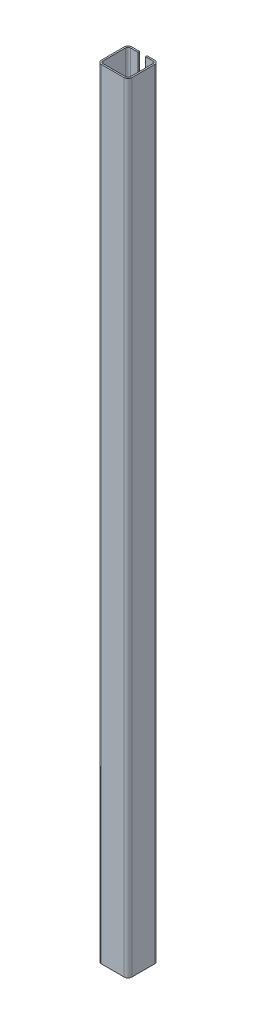
ISO-10303-21;
HEADER;
FILE_DESCRIPTION(('STEP AP214'),'2;1');
FILE_NAME('part.step','',(''),(''),'','','');
FILE_SCHEMA(('AUTOMOTIVE_DESIGN { 1 0 10303 214 1 1 1 1 }'));
ENDSEC;
DATA;
#1=APPLICATION_CONTEXT('core data for automotive mechanical design processes');
#2=APPLICATION_PROTOCOL_DEFINITION('international standard','automotive_design',2000,#1);
#3=PRODUCT_CONTEXT('',#1,'mechanical');
#4=PRODUCT('Part','Part','',(#3));
#5=PRODUCT_RELATED_PRODUCT_CATEGORY('part','',(#4));
#6=PRODUCT_DEFINITION_FORMATION('','',#4);
#7=PRODUCT_DEFINITION_CONTEXT('part definition',#1,'design');
#8=PRODUCT_DEFINITION('design','',#6,#7);
#9=PRODUCT_DEFINITION_SHAPE('','',#8);
#10=(LENGTH_UNIT() NAMED_UNIT(*) SI_UNIT(.MILLI.,.METRE.));
#11=(NAMED_UNIT(*) PLANE_ANGLE_UNIT() SI_UNIT($,.RADIAN.));
#12=(NAMED_UNIT(*) SI_UNIT($,.STERADIAN.) SOLID_ANGLE_UNIT());
#13=UNCERTAINTY_MEASURE_WITH_UNIT(LENGTH_MEASURE(1.E-05),#10,'distance_accuracy_value','');
#14=(GEOMETRIC_REPRESENTATION_CONTEXT(3) GLOBAL_UNCERTAINTY_ASSIGNED_CONTEXT((#13)) GLOBAL_UNIT_ASSIGNED_CONTEXT((#10,
#11,#12)) REPRESENTATION_CONTEXT('',''));
#15=CARTESIAN_POINT('',(0.,0.,0.));
#16=DIRECTION('',(0.,0.,1.));
#17=DIRECTION('',(1.,0.,0.));
#18=AXIS2_PLACEMENT_3D('',#15,#16,#17);
#19=CARTESIAN_POINT('',(-15.,1025.,-38.));
#20=DIRECTION('',(0.,0.,-1.));
#21=DIRECTION('',(-1.,0.,0.));
#22=AXIS2_PLACEMENT_3D('',#19,#20,#21);
#23=PLANE('',#22);
#24=DIRECTION('',(1.,0.,0.));
#25=VECTOR('',#24,1.);
#26=CARTESIAN_POINT('',(-15.,0.,-38.));
#27=LINE('',#26,#25);
#28=CARTESIAN_POINT('',(-15.,0.,-38.));
#29=VERTEX_POINT('',#28);
#30=CARTESIAN_POINT('',(-5.,0.,-38.));
#31=VERTEX_POINT('',#30);
#32=EDGE_CURVE('E222',#29,#31,#27,.T.);
#33=ORIENTED_EDGE('',*,*,#32,.T.);
#34=DIRECTION('',(0.,-1.,0.));
#35=VECTOR('',#34,1.);
#36=CARTESIAN_POINT('',(-5.,1025.,-38.));
#37=LINE('',#36,#35);
#38=CARTESIAN_POINT('',(-5.,1025.,-38.));
#39=VERTEX_POINT('',#38);
#40=EDGE_CURVE('E11',#39,#31,#37,.T.);
#41=ORIENTED_EDGE('',*,*,#40,.F.);
#42=DIRECTION('',(1.,0.,0.));
#43=VECTOR('',#42,1.);
#44=CARTESIAN_POINT('',(-15.,1025.,-38.));
#45=LINE('',#44,#43);
#46=CARTESIAN_POINT('',(-15.,1025.,-38.));
#47=VERTEX_POINT('',#46);
#48=EDGE_CURVE('E133',#47,#39,#45,.T.);
#49=ORIENTED_EDGE('',*,*,#48,.F.);
#50=DIRECTION('',(0.,-1.,0.));
#51=VECTOR('',#50,1.);
#52=CARTESIAN_POINT('',(-15.,1025.,-38.));
#53=LINE('',#52,#51);
#54=EDGE_CURVE('E218',#47,#29,#53,.T.);
#55=ORIENTED_EDGE('',*,*,#54,.T.);
#56=EDGE_LOOP('',(#33,#41,#49,#55));
#57=FACE_BOUND('',#56,.T.);
#58=ADVANCED_FACE('F40',(#57),#23,.F.);
#59=CARTESIAN_POINT('',(-5.,1025.,-40.));
#60=DIRECTION('',(1.,0.,0.));
#61=DIRECTION('',(0.,0.,-1.));
#62=AXIS2_PLACEMENT_3D('',#59,#60,#61);
#63=PLANE('',#62);
#64=DIRECTION('',(0.,0.,1.));
#65=VECTOR('',#64,1.);
#66=CARTESIAN_POINT('',(-5.,0.,-40.));
#67=LINE('',#66,#65);
#68=CARTESIAN_POINT('',(-5.,0.,-40.));
#69=VERTEX_POINT('',#68);
#70=EDGE_CURVE('E225',#69,#31,#67,.T.);
#71=ORIENTED_EDGE('',*,*,#70,.F.);
#72=DIRECTION('',(0.,-1.,0.));
#73=VECTOR('',#72,1.);
#74=CARTESIAN_POINT('',(-5.,1025.,-40.));
#75=LINE('',#74,#73);
#76=CARTESIAN_POINT('',(-5.,1025.,-40.));
#77=VERTEX_POINT('',#76);
#78=EDGE_CURVE('E49',#77,#69,#75,.T.);
#79=ORIENTED_EDGE('',*,*,#78,.F.);
#80=DIRECTION('',(0.,0.,1.));
#81=VECTOR('',#80,1.);
#82=CARTESIAN_POINT('',(-5.,1025.,-40.));
#83=LINE('',#82,#81);
#84=EDGE_CURVE('E345',#77,#39,#83,.T.);
#85=ORIENTED_EDGE('',*,*,#84,.T.);
#86=ORIENTED_EDGE('',*,*,#40,.T.);
#87=EDGE_LOOP('',(#71,#79,#85,#86));
#88=FACE_BOUND('',#87,.T.);
#89=ADVANCED_FACE('F332',(#88),#63,.T.);
#90=CARTESIAN_POINT('',(-15.,1025.,-40.));
#91=DIRECTION('',(0.,0.,-1.));
#92=DIRECTION('',(-1.,0.,0.));
#93=AXIS2_PLACEMENT_3D('',#90,#91,#92);
#94=PLANE('',#93);
#95=DIRECTION('',(1.,0.,0.));
#96=VECTOR('',#95,1.);
#97=CARTESIAN_POINT('',(-15.,0.,-40.));
#98=LINE('',#97,#96);
#99=CARTESIAN_POINT('',(-15.,0.,-40.));
#100=VERTEX_POINT('',#99);
#101=EDGE_CURVE('E228',#100,#69,#98,.T.);
#102=ORIENTED_EDGE('',*,*,#101,.F.);
#103=DIRECTION('',(0.,-1.,0.));
#104=VECTOR('',#103,1.);
#105=CARTESIAN_POINT('',(-15.,1025.,-40.));
#106=LINE('',#105,#104);
#107=CARTESIAN_POINT('',(-15.,1025.,-40.));
#108=VERTEX_POINT('',#107);
#109=EDGE_CURVE('E320',#108,#100,#106,.T.);
#110=ORIENTED_EDGE('',*,*,#109,.F.);
#111=DIRECTION('',(1.,0.,0.));
#112=VECTOR('',#111,1.);
#113=CARTESIAN_POINT('',(-15.,1025.,-40.));
#114=LINE('',#113,#112);
#115=EDGE_CURVE('E329',#108,#77,#114,.T.);
#116=ORIENTED_EDGE('',*,*,#115,.T.);
#117=ORIENTED_EDGE('',*,*,#78,.T.);
#118=EDGE_LOOP('',(#102,#110,#116,#117));
#119=FACE_BOUND('',#118,.T.);
#120=ADVANCED_FACE('F327',(#119),#94,.T.);
#121=CARTESIAN_POINT('',(-15.,1025.,-35.));
#122=DIRECTION('',(0.,-1.,0.));
#123=DIRECTION('',(0.,0.,-1.));
#124=AXIS2_PLACEMENT_3D('',#121,#122,#123);
#125=CYLINDRICAL_SURFACE('',#124,5.);
#126=CARTESIAN_POINT('',(-15.,0.,-35.));
#127=DIRECTION('',(0.,-1.,0.));
#128=DIRECTION('',(0.,0.,-1.));
#129=AXIS2_PLACEMENT_3D('',#126,#127,#128);
#130=CIRCLE('',#129,5.);
#131=CARTESIAN_POINT('',(-20.,0.,-35.));
#132=VERTEX_POINT('',#131);
#133=EDGE_CURVE('E231',#132,#100,#130,.T.);
#134=ORIENTED_EDGE('',*,*,#133,.F.);
#135=DIRECTION('',(0.,-1.,0.));
#136=VECTOR('',#135,1.);
#137=CARTESIAN_POINT('',(-20.,1025.,-35.));
#138=LINE('',#137,#136);
#139=CARTESIAN_POINT('',(-20.,1025.,-35.));
#140=VERTEX_POINT('',#139);
#141=EDGE_CURVE('E317',#140,#132,#138,.T.);
#142=ORIENTED_EDGE('',*,*,#141,.F.);
#143=CARTESIAN_POINT('',(-15.,1025.,-35.));
#144=DIRECTION('',(0.,-1.,0.));
#145=DIRECTION('',(0.,0.,-1.));
#146=AXIS2_PLACEMENT_3D('',#143,#144,#145);
#147=CIRCLE('',#146,5.);
#148=EDGE_CURVE('E342',#140,#108,#147,.T.);
#149=ORIENTED_EDGE('',*,*,#148,.T.);
#150=ORIENTED_EDGE('',*,*,#109,.T.);
#151=EDGE_LOOP('',(#134,#142,#149,#150));
#152=FACE_BOUND('',#151,.T.);
#153=ADVANCED_FACE('F339',(#152),#125,.T.);
#154=CARTESIAN_POINT('',(-20.,1025.,-5.00000000000004));
#155=DIRECTION('',(-1.,0.,0.));
#156=DIRECTION('',(0.,0.,1.));
#157=AXIS2_PLACEMENT_3D('',#154,#155,#156);
#158=PLANE('',#157);
#159=DIRECTION('',(0.,0.,-1.));
#160=VECTOR('',#159,1.);
#161=CARTESIAN_POINT('',(-20.,0.,-5.00000000000004));
#162=LINE('',#161,#160);
#163=CARTESIAN_POINT('',(-20.,0.,-5.00000000000003));
#164=VERTEX_POINT('',#163);
#165=EDGE_CURVE('E234',#164,#132,#162,.T.);
#166=ORIENTED_EDGE('',*,*,#165,.F.);
#167=DIRECTION('',(0.,-1.,0.));
#168=VECTOR('',#167,1.);
#169=CARTESIAN_POINT('',(-20.,1025.,-5.00000000000003));
#170=LINE('',#169,#168);
#171=CARTESIAN_POINT('',(-20.,1025.,-5.00000000000003));
#172=VERTEX_POINT('',#171);
#173=EDGE_CURVE('E314',#172,#164,#170,.T.);
#174=ORIENTED_EDGE('',*,*,#173,.F.);
#175=DIRECTION('',(0.,0.,-1.));
#176=VECTOR('',#175,1.);
#177=CARTESIAN_POINT('',(-20.,1025.,-5.00000000000004));
#178=LINE('',#177,#176);
#179=EDGE_CURVE('E347',#172,#140,#178,.T.);
#180=ORIENTED_EDGE('',*,*,#179,.T.);
#181=ORIENTED_EDGE('',*,*,#141,.T.);
#182=EDGE_LOOP('',(#166,#174,#180,#181));
#183=FACE_BOUND('',#182,.T.);
#184=ADVANCED_FACE('F420',(#183),#158,.T.);
#185=CARTESIAN_POINT('',(-15.,1025.,-5.));
#186=DIRECTION('',(0.,-1.,0.));
#187=DIRECTION('',(0.,0.,-1.));
#188=AXIS2_PLACEMENT_3D('',#185,#186,#187);
#189=CYLINDRICAL_SURFACE('',#188,5.);
#190=CARTESIAN_POINT('',(-15.,0.,-5.));
#191=DIRECTION('',(0.,-1.,0.));
#192=DIRECTION('',(0.,0.,-1.));
#193=AXIS2_PLACEMENT_3D('',#190,#191,#192);
#194=CIRCLE('',#193,5.);
#195=CARTESIAN_POINT('',(-15.,0.,0.));
#196=VERTEX_POINT('',#195);
#197=EDGE_CURVE('E237',#196,#164,#194,.T.);
#198=ORIENTED_EDGE('',*,*,#197,.F.);
#199=DIRECTION('',(0.,-1.,0.));
#200=VECTOR('',#199,1.);
#201=CARTESIAN_POINT('',(-15.,1025.,0.));
#202=LINE('',#201,#200);
#203=CARTESIAN_POINT('',(-15.,1025.,0.));
#204=VERTEX_POINT('',#203);
#205=EDGE_CURVE('E311',#204,#196,#202,.T.);
#206=ORIENTED_EDGE('',*,*,#205,.F.);
#207=CARTESIAN_POINT('',(-15.,1025.,-5.));
#208=DIRECTION('',(0.,-1.,0.));
#209=DIRECTION('',(0.,0.,-1.));
#210=AXIS2_PLACEMENT_3D('',#207,#208,#209);
#211=CIRCLE('',#210,5.);
#212=EDGE_CURVE('E353',#204,#172,#211,.T.);
#213=ORIENTED_EDGE('',*,*,#212,.T.);
#214=ORIENTED_EDGE('',*,*,#173,.T.);
#215=EDGE_LOOP('',(#198,#206,#213,#214));
#216=FACE_BOUND('',#215,.T.);
#217=ADVANCED_FACE('F423',(#216),#189,.T.);
#218=CARTESIAN_POINT('',(-15.,1025.,0.));
#219=DIRECTION('',(0.,0.,1.));
#220=DIRECTION('',(1.,0.,0.));
#221=AXIS2_PLACEMENT_3D('',#218,#219,#220);
#222=PLANE('',#221);
#223=DIRECTION('',(-1.,0.,0.));
#224=VECTOR('',#223,1.);
#225=CARTESIAN_POINT('',(-15.,0.,0.));
#226=LINE('',#225,#224);
#227=CARTESIAN_POINT('',(15.,0.,0.));
#228=VERTEX_POINT('',#227);
#229=EDGE_CURVE('E240',#228,#196,#226,.T.);
#230=ORIENTED_EDGE('',*,*,#229,.F.);
#231=DIRECTION('',(0.,-1.,0.));
#232=VECTOR('',#231,1.);
#233=CARTESIAN_POINT('',(15.,1025.,0.));
#234=LINE('',#233,#232);
#235=CARTESIAN_POINT('',(15.,1025.,0.));
#236=VERTEX_POINT('',#235);
#237=EDGE_CURVE('E308',#236,#228,#234,.T.);
#238=ORIENTED_EDGE('',*,*,#237,.F.);
#239=DIRECTION('',(-1.,0.,0.));
#240=VECTOR('',#239,1.);
#241=CARTESIAN_POINT('',(-15.,1025.,0.));
#242=LINE('',#241,#240);
#243=EDGE_CURVE('E356',#236,#204,#242,.T.);
#244=ORIENTED_EDGE('',*,*,#243,.T.);
#245=ORIENTED_EDGE('',*,*,#205,.T.);
#246=EDGE_LOOP('',(#230,#238,#244,#245));
#247=FACE_BOUND('',#246,.T.);
#248=ADVANCED_FACE('F427',(#247),#222,.T.);
#249=CARTESIAN_POINT('',(15.,1025.,-5.));
#250=DIRECTION('',(0.,-1.,0.));
#251=DIRECTION('',(0.,0.,-1.));
#252=AXIS2_PLACEMENT_3D('',#249,#250,#251);
#253=CYLINDRICAL_SURFACE('',#252,5.);
#254=CARTESIAN_POINT('',(15.,0.,-5.));
#255=DIRECTION('',(0.,-1.,0.));
#256=DIRECTION('',(0.,0.,1.));
#257=AXIS2_PLACEMENT_3D('',#254,#255,#256);
#258=CIRCLE('',#257,5.);
#259=CARTESIAN_POINT('',(20.,0.,-5.00000000000004));
#260=VERTEX_POINT('',#259);
#261=EDGE_CURVE('E243',#260,#228,#258,.T.);
#262=ORIENTED_EDGE('',*,*,#261,.F.);
#263=DIRECTION('',(0.,-1.,0.));
#264=VECTOR('',#263,1.);
#265=CARTESIAN_POINT('',(20.,1025.,-5.00000000000004));
#266=LINE('',#265,#264);
#267=CARTESIAN_POINT('',(20.,1025.,-5.00000000000004));
#268=VERTEX_POINT('',#267);
#269=EDGE_CURVE('E305',#268,#260,#266,.T.);
#270=ORIENTED_EDGE('',*,*,#269,.F.);
#271=CARTESIAN_POINT('',(15.,1025.,-5.));
#272=DIRECTION('',(0.,-1.,0.));
#273=DIRECTION('',(0.,0.,1.));
#274=AXIS2_PLACEMENT_3D('',#271,#272,#273);
#275=CIRCLE('',#274,5.);
#276=EDGE_CURVE('E360',#268,#236,#275,.T.);
#277=ORIENTED_EDGE('',*,*,#276,.T.);
#278=ORIENTED_EDGE('',*,*,#237,.T.);
#279=EDGE_LOOP('',(#262,#270,#277,#278));
#280=FACE_BOUND('',#279,.T.);
#281=ADVANCED_FACE('F431',(#280),#253,.T.);
#282=CARTESIAN_POINT('',(20.,1025.,-5.00000000000004));
#283=DIRECTION('',(1.,0.,0.));
#284=DIRECTION('',(0.,0.,-1.));
#285=AXIS2_PLACEMENT_3D('',#282,#283,#284);
#286=PLANE('',#285);
#287=DIRECTION('',(0.,0.,1.));
#288=VECTOR('',#287,1.);
#289=CARTESIAN_POINT('',(20.,0.,-5.00000000000004));
#290=LINE('',#289,#288);
#291=CARTESIAN_POINT('',(20.,0.,-35.));
#292=VERTEX_POINT('',#291);
#293=EDGE_CURVE('E246',#292,#260,#290,.T.);
#294=ORIENTED_EDGE('',*,*,#293,.F.);
#295=DIRECTION('',(0.,-1.,0.));
#296=VECTOR('',#295,1.);
#297=CARTESIAN_POINT('',(20.,1025.,-35.));
#298=LINE('',#297,#296);
#299=CARTESIAN_POINT('',(20.,1025.,-35.));
#300=VERTEX_POINT('',#299);
#301=EDGE_CURVE('E302',#300,#292,#298,.T.);
#302=ORIENTED_EDGE('',*,*,#301,.F.);
#303=DIRECTION('',(0.,0.,1.));
#304=VECTOR('',#303,1.);
#305=CARTESIAN_POINT('',(20.,1025.,-5.00000000000004));
#306=LINE('',#305,#304);
#307=EDGE_CURVE('E364',#300,#268,#306,.T.);
#308=ORIENTED_EDGE('',*,*,#307,.T.);
#309=ORIENTED_EDGE('',*,*,#269,.T.);
#310=EDGE_LOOP('',(#294,#302,#308,#309));
#311=FACE_BOUND('',#310,.T.);
#312=ADVANCED_FACE('F435',(#311),#286,.T.);
#313=CARTESIAN_POINT('',(15.,1025.,-35.));
#314=DIRECTION('',(0.,-1.,0.));
#315=DIRECTION('',(0.,0.,-1.));
#316=AXIS2_PLACEMENT_3D('',#313,#314,#315);
#317=CYLINDRICAL_SURFACE('',#316,5.);
#318=CARTESIAN_POINT('',(15.,0.,-35.));
#319=DIRECTION('',(0.,-1.,0.));
#320=DIRECTION('',(0.,0.,1.));
#321=AXIS2_PLACEMENT_3D('',#318,#319,#320);
#322=CIRCLE('',#321,5.);
#323=CARTESIAN_POINT('',(15.,0.,-40.));
#324=VERTEX_POINT('',#323);
#325=EDGE_CURVE('E249',#324,#292,#322,.T.);
#326=ORIENTED_EDGE('',*,*,#325,.F.);
#327=DIRECTION('',(0.,-1.,0.));
#328=VECTOR('',#327,1.);
#329=CARTESIAN_POINT('',(15.,1025.,-40.));
#330=LINE('',#329,#328);
#331=CARTESIAN_POINT('',(15.,1025.,-40.));
#332=VERTEX_POINT('',#331);
#333=EDGE_CURVE('E299',#332,#324,#330,.T.);
#334=ORIENTED_EDGE('',*,*,#333,.F.);
#335=CARTESIAN_POINT('',(15.,1025.,-35.));
#336=DIRECTION('',(0.,-1.,0.));
#337=DIRECTION('',(0.,0.,1.));
#338=AXIS2_PLACEMENT_3D('',#335,#336,#337);
#339=CIRCLE('',#338,5.);
#340=EDGE_CURVE('E368',#332,#300,#339,.T.);
#341=ORIENTED_EDGE('',*,*,#340,.T.);
#342=ORIENTED_EDGE('',*,*,#301,.T.);
#343=EDGE_LOOP('',(#326,#334,#341,#342));
#344=FACE_BOUND('',#343,.T.);
#345=ADVANCED_FACE('F439',(#344),#317,.T.);
#346=CARTESIAN_POINT('',(5.,1025.,-40.));
#347=DIRECTION('',(0.,0.,-1.));
#348=DIRECTION('',(-1.,0.,0.));
#349=AXIS2_PLACEMENT_3D('',#346,#347,#348);
#350=PLANE('',#349);
#351=DIRECTION('',(1.,0.,0.));
#352=VECTOR('',#351,1.);
#353=CARTESIAN_POINT('',(5.,0.,-40.));
#354=LINE('',#353,#352);
#355=CARTESIAN_POINT('',(5.,0.,-40.));
#356=VERTEX_POINT('',#355);
#357=EDGE_CURVE('E252',#356,#324,#354,.T.);
#358=ORIENTED_EDGE('',*,*,#357,.F.);
#359=DIRECTION('',(0.,-1.,0.));
#360=VECTOR('',#359,1.);
#361=CARTESIAN_POINT('',(5.,1025.,-40.));
#362=LINE('',#361,#360);
#363=CARTESIAN_POINT('',(5.,1025.,-40.));
#364=VERTEX_POINT('',#363);
#365=EDGE_CURVE('E296',#364,#356,#362,.T.);
#366=ORIENTED_EDGE('',*,*,#365,.F.);
#367=DIRECTION('',(1.,0.,0.));
#368=VECTOR('',#367,1.);
#369=CARTESIAN_POINT('',(5.,1025.,-40.));
#370=LINE('',#369,#368);
#371=EDGE_CURVE('E372',#364,#332,#370,.T.);
#372=ORIENTED_EDGE('',*,*,#371,.T.);
#373=ORIENTED_EDGE('',*,*,#333,.T.);
#374=EDGE_LOOP('',(#358,#366,#372,#373));
#375=FACE_BOUND('',#374,.T.);
#376=ADVANCED_FACE('F443',(#375),#350,.T.);
#377=CARTESIAN_POINT('',(5.,1025.,-38.));
#378=DIRECTION('',(-1.,0.,0.));
#379=DIRECTION('',(0.,0.,1.));
#380=AXIS2_PLACEMENT_3D('',#377,#378,#379);
#381=PLANE('',#380);
#382=DIRECTION('',(0.,0.,-1.));
#383=VECTOR('',#382,1.);
#384=CARTESIAN_POINT('',(5.,0.,-38.));
#385=LINE('',#384,#383);
#386=CARTESIAN_POINT('',(5.,0.,-38.));
#387=VERTEX_POINT('',#386);
#388=EDGE_CURVE('E255',#387,#356,#385,.T.);
#389=ORIENTED_EDGE('',*,*,#388,.F.);
#390=DIRECTION('',(0.,-1.,0.));
#391=VECTOR('',#390,1.);
#392=CARTESIAN_POINT('',(5.,1025.,-38.));
#393=LINE('',#392,#391);
#394=CARTESIAN_POINT('',(5.,1025.,-38.));
#395=VERTEX_POINT('',#394);
#396=EDGE_CURVE('E293',#395,#387,#393,.T.);
#397=ORIENTED_EDGE('',*,*,#396,.F.);
#398=DIRECTION('',(0.,0.,-1.));
#399=VECTOR('',#398,1.);
#400=CARTESIAN_POINT('',(5.,1025.,-38.));
#401=LINE('',#400,#399);
#402=EDGE_CURVE('E375',#395,#364,#401,.T.);
#403=ORIENTED_EDGE('',*,*,#402,.T.);
#404=ORIENTED_EDGE('',*,*,#365,.T.);
#405=EDGE_LOOP('',(#389,#397,#403,#404));
#406=FACE_BOUND('',#405,.T.);
#407=ADVANCED_FACE('F447',(#406),#381,.T.);
#408=CARTESIAN_POINT('',(5.,1025.,-38.));
#409=DIRECTION('',(0.,0.,-1.));
#410=DIRECTION('',(-1.,0.,0.));
#411=AXIS2_PLACEMENT_3D('',#408,#409,#410);
#412=PLANE('',#411);
#413=DIRECTION('',(1.,0.,0.));
#414=VECTOR('',#413,1.);
#415=CARTESIAN_POINT('',(5.,0.,-38.));
#416=LINE('',#415,#414);
#417=CARTESIAN_POINT('',(15.,0.,-38.));
#418=VERTEX_POINT('',#417);
#419=EDGE_CURVE('E258',#387,#418,#416,.T.);
#420=ORIENTED_EDGE('',*,*,#419,.T.);
#421=DIRECTION('',(0.,-1.,0.));
#422=VECTOR('',#421,1.);
#423=CARTESIAN_POINT('',(15.,1025.,-38.));
#424=LINE('',#423,#422);
#425=CARTESIAN_POINT('',(15.,1025.,-38.));
#426=VERTEX_POINT('',#425);
#427=EDGE_CURVE('E289',#426,#418,#424,.T.);
#428=ORIENTED_EDGE('',*,*,#427,.F.);
#429=DIRECTION('',(1.,0.,0.));
#430=VECTOR('',#429,1.);
#431=CARTESIAN_POINT('',(5.,1025.,-38.));
#432=LINE('',#431,#430);
#433=EDGE_CURVE('E378',#395,#426,#432,.T.);
#434=ORIENTED_EDGE('',*,*,#433,.F.);
#435=ORIENTED_EDGE('',*,*,#396,.T.);
#436=EDGE_LOOP('',(#420,#428,#434,#435));
#437=FACE_BOUND('',#436,.T.);
#438=ADVANCED_FACE('F451',(#437),#412,.F.);
#439=CARTESIAN_POINT('',(15.,1025.,-35.));
#440=DIRECTION('',(0.,-1.,0.));
#441=DIRECTION('',(0.,0.,-1.));
#442=AXIS2_PLACEMENT_3D('',#439,#440,#441);
#443=CYLINDRICAL_SURFACE('',#442,3.);
#444=CARTESIAN_POINT('',(15.,0.,-35.));
#445=DIRECTION('',(0.,1.,0.));
#446=DIRECTION('',(1.,0.,0.));
#447=AXIS2_PLACEMENT_3D('',#444,#445,#446);
#448=CIRCLE('',#447,3.);
#449=CARTESIAN_POINT('',(18.,0.,-35.));
#450=VERTEX_POINT('',#449);
#451=EDGE_CURVE('E260',#418,#450,#448,.F.);
#452=ORIENTED_EDGE('',*,*,#451,.T.);
#453=DIRECTION('',(0.,-1.,0.));
#454=VECTOR('',#453,1.);
#455=CARTESIAN_POINT('',(18.,1025.,-35.));
#456=LINE('',#455,#454);
#457=CARTESIAN_POINT('',(18.,1025.,-35.));
#458=VERTEX_POINT('',#457);
#459=EDGE_CURVE('E285',#458,#450,#456,.T.);
#460=ORIENTED_EDGE('',*,*,#459,.F.);
#461=CARTESIAN_POINT('',(15.,1025.,-35.));
#462=DIRECTION('',(0.,1.,0.));
#463=DIRECTION('',(1.,0.,0.));
#464=AXIS2_PLACEMENT_3D('',#461,#462,#463);
#465=CIRCLE('',#464,3.);
#466=EDGE_CURVE('E380',#426,#458,#465,.F.);
#467=ORIENTED_EDGE('',*,*,#466,.F.);
#468=ORIENTED_EDGE('',*,*,#427,.T.);
#469=EDGE_LOOP('',(#452,#460,#467,#468));
#470=FACE_BOUND('',#469,.T.);
#471=ADVANCED_FACE('F455',(#470),#443,.F.);
#472=CARTESIAN_POINT('',(18.,1025.,-5.00000000000004));
#473=DIRECTION('',(1.,0.,0.));
#474=DIRECTION('',(0.,0.,-1.));
#475=AXIS2_PLACEMENT_3D('',#472,#473,#474);
#476=PLANE('',#475);
#477=DIRECTION('',(0.,0.,-1.));
#478=VECTOR('',#477,1.);
#479=CARTESIAN_POINT('',(18.,0.,-5.00000000000004));
#480=LINE('',#479,#478);
#481=CARTESIAN_POINT('',(18.,0.,-5.00000000000002));
#482=VERTEX_POINT('',#481);
#483=EDGE_CURVE('E262',#450,#482,#480,.F.);
#484=ORIENTED_EDGE('',*,*,#483,.T.);
#485=DIRECTION('',(0.,-1.,0.));
#486=VECTOR('',#485,1.);
#487=CARTESIAN_POINT('',(18.,1025.,-5.00000000000002));
#488=LINE('',#487,#486);
#489=CARTESIAN_POINT('',(18.,1025.,-5.00000000000002));
#490=VERTEX_POINT('',#489);
#491=EDGE_CURVE('E281',#490,#482,#488,.T.);
#492=ORIENTED_EDGE('',*,*,#491,.F.);
#493=DIRECTION('',(0.,0.,-1.));
#494=VECTOR('',#493,1.);
#495=CARTESIAN_POINT('',(18.,1025.,-5.00000000000004));
#496=LINE('',#495,#494);
#497=EDGE_CURVE('E382',#458,#490,#496,.F.);
#498=ORIENTED_EDGE('',*,*,#497,.F.);
#499=ORIENTED_EDGE('',*,*,#459,.T.);
#500=EDGE_LOOP('',(#484,#492,#498,#499));
#501=FACE_BOUND('',#500,.T.);
#502=ADVANCED_FACE('F459',(#501),#476,.F.);
#503=CARTESIAN_POINT('',(15.,1025.,-5.));
#504=DIRECTION('',(0.,-1.,0.));
#505=DIRECTION('',(0.,0.,-1.));
#506=AXIS2_PLACEMENT_3D('',#503,#504,#505);
#507=CYLINDRICAL_SURFACE('',#506,3.);
#508=CARTESIAN_POINT('',(15.,0.,-5.));
#509=DIRECTION('',(0.,1.,0.));
#510=DIRECTION('',(1.,0.,0.));
#511=AXIS2_PLACEMENT_3D('',#508,#509,#510);
#512=CIRCLE('',#511,3.);
#513=CARTESIAN_POINT('',(15.,0.,-2.));
#514=VERTEX_POINT('',#513);
#515=EDGE_CURVE('E264',#482,#514,#512,.F.);
#516=ORIENTED_EDGE('',*,*,#515,.T.);
#517=DIRECTION('',(0.,-1.,0.));
#518=VECTOR('',#517,1.);
#519=CARTESIAN_POINT('',(15.,1025.,-2.));
#520=LINE('',#519,#518);
#521=CARTESIAN_POINT('',(15.,1025.,-2.));
#522=VERTEX_POINT('',#521);
#523=EDGE_CURVE('E277',#522,#514,#520,.T.);
#524=ORIENTED_EDGE('',*,*,#523,.F.);
#525=CARTESIAN_POINT('',(15.,1025.,-5.));
#526=DIRECTION('',(0.,1.,0.));
#527=DIRECTION('',(1.,0.,0.));
#528=AXIS2_PLACEMENT_3D('',#525,#526,#527);
#529=CIRCLE('',#528,3.);
#530=EDGE_CURVE('E385',#490,#522,#529,.F.);
#531=ORIENTED_EDGE('',*,*,#530,.F.);
#532=ORIENTED_EDGE('',*,*,#491,.T.);
#533=EDGE_LOOP('',(#516,#524,#531,#532));
#534=FACE_BOUND('',#533,.T.);
#535=ADVANCED_FACE('F393',(#534),#507,.F.);
#536=CARTESIAN_POINT('',(-15.,1025.,-2.));
#537=DIRECTION('',(0.,0.,1.));
#538=DIRECTION('',(1.,0.,0.));
#539=AXIS2_PLACEMENT_3D('',#536,#537,#538);
#540=PLANE('',#539);
#541=DIRECTION('',(1.,0.,0.));
#542=VECTOR('',#541,1.);
#543=CARTESIAN_POINT('',(-15.,0.,-2.));
#544=LINE('',#543,#542);
#545=CARTESIAN_POINT('',(-15.,0.,-2.));
#546=VERTEX_POINT('',#545);
#547=EDGE_CURVE('E266',#514,#546,#544,.F.);
#548=ORIENTED_EDGE('',*,*,#547,.T.);
#549=DIRECTION('',(0.,-1.,0.));
#550=VECTOR('',#549,1.);
#551=CARTESIAN_POINT('',(-15.,1025.,-2.));
#552=LINE('',#551,#550);
#553=CARTESIAN_POINT('',(-15.,1025.,-2.));
#554=VERTEX_POINT('',#553);
#555=EDGE_CURVE('E210',#554,#546,#552,.T.);
#556=ORIENTED_EDGE('',*,*,#555,.F.);
#557=DIRECTION('',(1.,0.,0.));
#558=VECTOR('',#557,1.);
#559=CARTESIAN_POINT('',(-15.,1025.,-2.));
#560=LINE('',#559,#558);
#561=EDGE_CURVE('E199',#522,#554,#560,.F.);
#562=ORIENTED_EDGE('',*,*,#561,.F.);
#563=ORIENTED_EDGE('',*,*,#523,.T.);
#564=EDGE_LOOP('',(#548,#556,#562,#563));
#565=FACE_BOUND('',#564,.T.);
#566=ADVANCED_FACE('F397',(#565),#540,.F.);
#567=CARTESIAN_POINT('',(-15.,1025.,-5.));
#568=DIRECTION('',(0.,-1.,0.));
#569=DIRECTION('',(0.,0.,-1.));
#570=AXIS2_PLACEMENT_3D('',#567,#568,#569);
#571=CYLINDRICAL_SURFACE('',#570,3.);
#572=CARTESIAN_POINT('',(-15.,0.,-5.));
#573=DIRECTION('',(0.,1.,0.));
#574=DIRECTION('',(1.,0.,0.));
#575=AXIS2_PLACEMENT_3D('',#572,#573,#574);
#576=CIRCLE('',#575,3.);
#577=CARTESIAN_POINT('',(-18.,0.,-5.00000000000003));
#578=VERTEX_POINT('',#577);
#579=EDGE_CURVE('E208',#546,#578,#576,.F.);
#580=ORIENTED_EDGE('',*,*,#579,.T.);
#581=DIRECTION('',(0.,-1.,0.));
#582=VECTOR('',#581,1.);
#583=CARTESIAN_POINT('',(-18.,1025.,-5.00000000000003));
#584=LINE('',#583,#582);
#585=CARTESIAN_POINT('',(-18.,1025.,-5.00000000000003));
#586=VERTEX_POINT('',#585);
#587=EDGE_CURVE('E205',#586,#578,#584,.T.);
#588=ORIENTED_EDGE('',*,*,#587,.F.);
#589=CARTESIAN_POINT('',(-15.,1025.,-5.));
#590=DIRECTION('',(0.,1.,0.));
#591=DIRECTION('',(1.,0.,0.));
#592=AXIS2_PLACEMENT_3D('',#589,#590,#591);
#593=CIRCLE('',#592,3.);
#594=EDGE_CURVE('E193',#554,#586,#593,.F.);
#595=ORIENTED_EDGE('',*,*,#594,.F.);
#596=ORIENTED_EDGE('',*,*,#555,.T.);
#597=EDGE_LOOP('',(#580,#588,#595,#596));
#598=FACE_BOUND('',#597,.T.);
#599=ADVANCED_FACE('F206',(#598),#571,.F.);
#600=CARTESIAN_POINT('',(-18.,1025.,-5.00000000000004));
#601=DIRECTION('',(-1.,0.,0.));
#602=DIRECTION('',(0.,0.,1.));
#603=AXIS2_PLACEMENT_3D('',#600,#601,#602);
#604=PLANE('',#603);
#605=DIRECTION('',(0.,0.,-1.));
#606=VECTOR('',#605,1.);
#607=CARTESIAN_POINT('',(-18.,0.,-5.00000000000004));
#608=LINE('',#607,#606);
#609=CARTESIAN_POINT('',(-18.,0.,-35.));
#610=VERTEX_POINT('',#609);
#611=EDGE_CURVE('E121',#578,#610,#608,.T.);
#612=ORIENTED_EDGE('',*,*,#611,.T.);
#613=DIRECTION('',(0.,-1.,0.));
#614=VECTOR('',#613,1.);
#615=CARTESIAN_POINT('',(-18.,1025.,-35.));
#616=LINE('',#615,#614);
#617=CARTESIAN_POINT('',(-18.,1025.,-35.));
#618=VERTEX_POINT('',#617);
#619=EDGE_CURVE('E211',#618,#610,#616,.T.);
#620=ORIENTED_EDGE('',*,*,#619,.F.);
#621=DIRECTION('',(0.,0.,-1.));
#622=VECTOR('',#621,1.);
#623=CARTESIAN_POINT('',(-18.,1025.,-5.00000000000004));
#624=LINE('',#623,#622);
#625=EDGE_CURVE('E197',#586,#618,#624,.T.);
#626=ORIENTED_EDGE('',*,*,#625,.F.);
#627=ORIENTED_EDGE('',*,*,#587,.T.);
#628=EDGE_LOOP('',(#612,#620,#626,#627));
#629=FACE_BOUND('',#628,.T.);
#630=ADVANCED_FACE('F213',(#629),#604,.F.);
#631=CARTESIAN_POINT('',(-15.,1025.,-35.));
#632=DIRECTION('',(0.,-1.,0.));
#633=DIRECTION('',(0.,0.,-1.));
#634=AXIS2_PLACEMENT_3D('',#631,#632,#633);
#635=CYLINDRICAL_SURFACE('',#634,3.);
#636=CARTESIAN_POINT('',(-15.,0.,-35.));
#637=DIRECTION('',(0.,1.,0.));
#638=DIRECTION('',(1.,0.,0.));
#639=AXIS2_PLACEMENT_3D('',#636,#637,#638);
#640=CIRCLE('',#639,3.);
#641=EDGE_CURVE('E127',#610,#29,#640,.F.);
#642=ORIENTED_EDGE('',*,*,#641,.T.);
#643=ORIENTED_EDGE('',*,*,#54,.F.);
#644=CARTESIAN_POINT('',(-15.,1025.,-35.));
#645=DIRECTION('',(0.,1.,0.));
#646=DIRECTION('',(1.,0.,0.));
#647=AXIS2_PLACEMENT_3D('',#644,#645,#646);
#648=CIRCLE('',#647,3.);
#649=EDGE_CURVE('E57',#618,#47,#648,.F.);
#650=ORIENTED_EDGE('',*,*,#649,.F.);
#651=ORIENTED_EDGE('',*,*,#619,.T.);
#652=EDGE_LOOP('',(#642,#643,#650,#651));
#653=FACE_BOUND('',#652,.T.);
#654=ADVANCED_FACE('F399',(#653),#635,.F.);
#655=CARTESIAN_POINT('',(-15.,1025.,-35.));
#656=DIRECTION('',(0.,-1.,0.));
#657=DIRECTION('',(-1.,0.,0.));
#658=AXIS2_PLACEMENT_3D('',#655,#656,#657);
#659=PLANE('',#658);
#660=ORIENTED_EDGE('',*,*,#48,.T.);
#661=ORIENTED_EDGE('',*,*,#84,.F.);
#662=ORIENTED_EDGE('',*,*,#115,.F.);
#663=ORIENTED_EDGE('',*,*,#148,.F.);
#664=ORIENTED_EDGE('',*,*,#179,.F.);
#665=ORIENTED_EDGE('',*,*,#212,.F.);
#666=ORIENTED_EDGE('',*,*,#243,.F.);
#667=ORIENTED_EDGE('',*,*,#276,.F.);
#668=ORIENTED_EDGE('',*,*,#307,.F.);
#669=ORIENTED_EDGE('',*,*,#340,.F.);
#670=ORIENTED_EDGE('',*,*,#371,.F.);
#671=ORIENTED_EDGE('',*,*,#402,.F.);
#672=ORIENTED_EDGE('',*,*,#433,.T.);
#673=ORIENTED_EDGE('',*,*,#466,.T.);
#674=ORIENTED_EDGE('',*,*,#497,.T.);
#675=ORIENTED_EDGE('',*,*,#530,.T.);
#676=ORIENTED_EDGE('',*,*,#561,.T.);
#677=ORIENTED_EDGE('',*,*,#594,.T.);
#678=ORIENTED_EDGE('',*,*,#625,.T.);
#679=ORIENTED_EDGE('',*,*,#649,.T.);
#680=EDGE_LOOP('',(#660,#661,#662,#663,#664,#665,#666,#667,#668,#669,#670,#671,#672,#673,#674,
#675,#676,#677,#678,#679));
#681=FACE_BOUND('',#680,.T.);
#682=ADVANCED_FACE('F195',(#681),#659,.F.);
#683=CARTESIAN_POINT('',(-15.,0.,-35.));
#684=DIRECTION('',(0.,-1.,0.));
#685=DIRECTION('',(-1.,0.,0.));
#686=AXIS2_PLACEMENT_3D('',#683,#684,#685);
#687=PLANE('',#686);
#688=ORIENTED_EDGE('',*,*,#32,.F.);
#689=ORIENTED_EDGE('',*,*,#641,.F.);
#690=ORIENTED_EDGE('',*,*,#611,.F.);
#691=ORIENTED_EDGE('',*,*,#579,.F.);
#692=ORIENTED_EDGE('',*,*,#547,.F.);
#693=ORIENTED_EDGE('',*,*,#515,.F.);
#694=ORIENTED_EDGE('',*,*,#483,.F.);
#695=ORIENTED_EDGE('',*,*,#451,.F.);
#696=ORIENTED_EDGE('',*,*,#419,.F.);
#697=ORIENTED_EDGE('',*,*,#388,.T.);
#698=ORIENTED_EDGE('',*,*,#357,.T.);
#699=ORIENTED_EDGE('',*,*,#325,.T.);
#700=ORIENTED_EDGE('',*,*,#293,.T.);
#701=ORIENTED_EDGE('',*,*,#261,.T.);
#702=ORIENTED_EDGE('',*,*,#229,.T.);
#703=ORIENTED_EDGE('',*,*,#197,.T.);
#704=ORIENTED_EDGE('',*,*,#165,.T.);
#705=ORIENTED_EDGE('',*,*,#133,.T.);
#706=ORIENTED_EDGE('',*,*,#101,.T.);
#707=ORIENTED_EDGE('',*,*,#70,.T.);
#708=EDGE_LOOP('',(#688,#689,#690,#691,#692,#693,#694,#695,#696,#697,#698,#699,#700,#701,#702,
#703,#704,#705,#706,#707));
#709=FACE_BOUND('',#708,.T.);
#710=ADVANCED_FACE('F335',(#709),#687,.T.);
#711=CLOSED_SHELL('',(#58,#89,#120,#153,#184,#217,#248,#281,#312,#345,#376,#407,#438,#471,#502,
#535,#566,#599,#630,#654,#682,#710));
#712=MANIFOLD_SOLID_BREP('B2',#711);
#713=ADVANCED_BREP_SHAPE_REPRESENTATION('',(#18,#712),#14);
#714=SHAPE_DEFINITION_REPRESENTATION(#9,#713);
ENDSEC;
END-ISO-10303-21;
